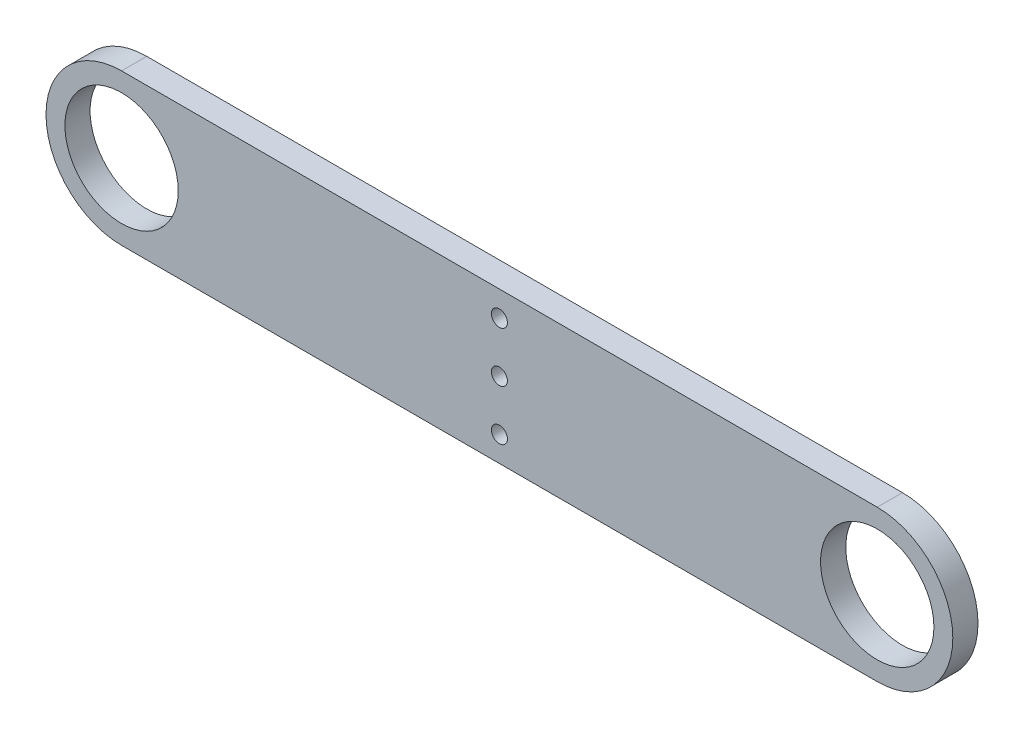
ISO-10303-21;
HEADER;
FILE_DESCRIPTION(('STEP AP214'),'2;1');
FILE_NAME('part.step','',(''),(''),'','','');
FILE_SCHEMA(('AUTOMOTIVE_DESIGN { 1 0 10303 214 1 1 1 1 }'));
ENDSEC;
DATA;
#1=APPLICATION_CONTEXT('core data for automotive mechanical design processes');
#2=APPLICATION_PROTOCOL_DEFINITION('international standard','automotive_design',2000,#1);
#3=PRODUCT_CONTEXT('',#1,'mechanical');
#4=PRODUCT('Part','Part','',(#3));
#5=PRODUCT_RELATED_PRODUCT_CATEGORY('part','',(#4));
#6=PRODUCT_DEFINITION_FORMATION('','',#4);
#7=PRODUCT_DEFINITION_CONTEXT('part definition',#1,'design');
#8=PRODUCT_DEFINITION('design','',#6,#7);
#9=PRODUCT_DEFINITION_SHAPE('','',#8);
#10=(LENGTH_UNIT() NAMED_UNIT(*) SI_UNIT(.MILLI.,.METRE.));
#11=(NAMED_UNIT(*) PLANE_ANGLE_UNIT() SI_UNIT($,.RADIAN.));
#12=(NAMED_UNIT(*) SI_UNIT($,.STERADIAN.) SOLID_ANGLE_UNIT());
#13=UNCERTAINTY_MEASURE_WITH_UNIT(LENGTH_MEASURE(1.E-05),#10,'distance_accuracy_value','');
#14=(GEOMETRIC_REPRESENTATION_CONTEXT(3) GLOBAL_UNCERTAINTY_ASSIGNED_CONTEXT((#13)) GLOBAL_UNIT_ASSIGNED_CONTEXT((#10,
#11,#12)) REPRESENTATION_CONTEXT('',''));
#15=CARTESIAN_POINT('',(0.,0.,0.));
#16=DIRECTION('',(0.,0.,1.));
#17=DIRECTION('',(1.,0.,0.));
#18=AXIS2_PLACEMENT_3D('',#15,#16,#17);
#19=CARTESIAN_POINT('',(0.,19.05,6.35));
#20=DIRECTION('',(0.,1.,0.));
#21=DIRECTION('',(0.,0.,1.));
#22=AXIS2_PLACEMENT_3D('',#19,#20,#21);
#23=PLANE('',#22);
#24=DIRECTION('',(1.,0.,0.));
#25=VECTOR('',#24,1.);
#26=CARTESIAN_POINT('',(0.,19.05,0.));
#27=LINE('',#26,#25);
#28=CARTESIAN_POINT('',(-95.25,19.05,0.));
#29=VERTEX_POINT('',#28);
#30=CARTESIAN_POINT('',(95.25,19.05,0.));
#31=VERTEX_POINT('',#30);
#32=EDGE_CURVE('E115',#29,#31,#27,.T.);
#33=ORIENTED_EDGE('',*,*,#32,.F.);
#34=DIRECTION('',(0.,0.,-1.));
#35=VECTOR('',#34,1.);
#36=CARTESIAN_POINT('',(-95.25,19.05,6.35));
#37=LINE('',#36,#35);
#38=CARTESIAN_POINT('',(-95.25,19.05,6.35));
#39=VERTEX_POINT('',#38);
#40=EDGE_CURVE('E11',#39,#29,#37,.T.);
#41=ORIENTED_EDGE('',*,*,#40,.F.);
#42=DIRECTION('',(1.,0.,0.));
#43=VECTOR('',#42,1.);
#44=CARTESIAN_POINT('',(0.,19.05,6.35));
#45=LINE('',#44,#43);
#46=CARTESIAN_POINT('',(95.25,19.05,6.35));
#47=VERTEX_POINT('',#46);
#48=EDGE_CURVE('E85',#39,#47,#45,.T.);
#49=ORIENTED_EDGE('',*,*,#48,.T.);
#50=DIRECTION('',(0.,0.,-1.));
#51=VECTOR('',#50,1.);
#52=CARTESIAN_POINT('',(95.25,19.05,6.35));
#53=LINE('',#52,#51);
#54=EDGE_CURVE('E52',#47,#31,#53,.T.);
#55=ORIENTED_EDGE('',*,*,#54,.T.);
#56=EDGE_LOOP('',(#33,#41,#49,#55));
#57=FACE_BOUND('',#56,.T.);
#58=ADVANCED_FACE('F35',(#57),#23,.T.);
#59=CARTESIAN_POINT('',(-95.25,0.,6.35));
#60=DIRECTION('',(0.,0.,-1.));
#61=DIRECTION('',(-1.,0.,0.));
#62=AXIS2_PLACEMENT_3D('',#59,#60,#61);
#63=CYLINDRICAL_SURFACE('',#62,19.05);
#64=CARTESIAN_POINT('',(-95.25,0.,0.));
#65=DIRECTION('',(0.,0.,1.));
#66=DIRECTION('',(1.,0.,0.));
#67=AXIS2_PLACEMENT_3D('',#64,#65,#66);
#68=CIRCLE('',#67,19.05);
#69=CARTESIAN_POINT('',(-95.25,-19.05,0.));
#70=VERTEX_POINT('',#69);
#71=EDGE_CURVE('E91',#29,#70,#68,.T.);
#72=ORIENTED_EDGE('',*,*,#71,.T.);
#73=DIRECTION('',(0.,0.,-1.));
#74=VECTOR('',#73,1.);
#75=CARTESIAN_POINT('',(-95.25,-19.05,6.35));
#76=LINE('',#75,#74);
#77=CARTESIAN_POINT('',(-95.25,-19.05,6.35));
#78=VERTEX_POINT('',#77);
#79=EDGE_CURVE('E44',#78,#70,#76,.T.);
#80=ORIENTED_EDGE('',*,*,#79,.F.);
#81=CARTESIAN_POINT('',(-95.25,0.,6.35));
#82=DIRECTION('',(0.,0.,1.));
#83=DIRECTION('',(1.,0.,0.));
#84=AXIS2_PLACEMENT_3D('',#81,#82,#83);
#85=CIRCLE('',#84,19.05);
#86=EDGE_CURVE('E78',#39,#78,#85,.T.);
#87=ORIENTED_EDGE('',*,*,#86,.F.);
#88=ORIENTED_EDGE('',*,*,#40,.T.);
#89=EDGE_LOOP('',(#72,#80,#87,#88));
#90=FACE_BOUND('',#89,.T.);
#91=ADVANCED_FACE('F89',(#90),#63,.T.);
#92=CARTESIAN_POINT('',(0.,-19.05,6.35));
#93=DIRECTION('',(0.,-1.,0.));
#94=DIRECTION('',(1.,0.,0.));
#95=AXIS2_PLACEMENT_3D('',#92,#93,#94);
#96=PLANE('',#95);
#97=DIRECTION('',(-1.,0.,0.));
#98=VECTOR('',#97,1.);
#99=CARTESIAN_POINT('',(0.,-19.05,0.));
#100=LINE('',#99,#98);
#101=CARTESIAN_POINT('',(95.25,-19.05,0.));
#102=VERTEX_POINT('',#101);
#103=EDGE_CURVE('E118',#102,#70,#100,.T.);
#104=ORIENTED_EDGE('',*,*,#103,.F.);
#105=DIRECTION('',(0.,0.,-1.));
#106=VECTOR('',#105,1.);
#107=CARTESIAN_POINT('',(95.25,-19.05,6.35));
#108=LINE('',#107,#106);
#109=CARTESIAN_POINT('',(95.25,-19.05,6.35));
#110=VERTEX_POINT('',#109);
#111=EDGE_CURVE('E65',#110,#102,#108,.T.);
#112=ORIENTED_EDGE('',*,*,#111,.F.);
#113=DIRECTION('',(-1.,0.,0.));
#114=VECTOR('',#113,1.);
#115=CARTESIAN_POINT('',(0.,-19.05,6.35));
#116=LINE('',#115,#114);
#117=EDGE_CURVE('E84',#110,#78,#116,.T.);
#118=ORIENTED_EDGE('',*,*,#117,.T.);
#119=ORIENTED_EDGE('',*,*,#79,.T.);
#120=EDGE_LOOP('',(#104,#112,#118,#119));
#121=FACE_BOUND('',#120,.T.);
#122=ADVANCED_FACE('F94',(#121),#96,.T.);
#123=CARTESIAN_POINT('',(95.25,0.,6.35));
#124=DIRECTION('',(0.,0.,-1.));
#125=DIRECTION('',(-1.,0.,0.));
#126=AXIS2_PLACEMENT_3D('',#123,#124,#125);
#127=CYLINDRICAL_SURFACE('',#126,14.2875);
#128=CARTESIAN_POINT('',(95.25,0.,6.35));
#129=DIRECTION('',(0.,0.,1.));
#130=DIRECTION('',(1.,0.,0.));
#131=AXIS2_PLACEMENT_3D('',#128,#129,#130);
#132=CIRCLE('',#131,14.2875);
#133=CARTESIAN_POINT('',(109.5375,0.,6.35));
#134=VERTEX_POINT('',#133);
#135=EDGE_CURVE('E106',#134,#134,#132,.T.);
#136=ORIENTED_EDGE('',*,*,#135,.T.);
#137=EDGE_LOOP('',(#136));
#138=FACE_BOUND('',#137,.T.);
#139=CARTESIAN_POINT('',(95.25,0.,0.));
#140=DIRECTION('',(0.,0.,1.));
#141=DIRECTION('',(1.,0.,0.));
#142=AXIS2_PLACEMENT_3D('',#139,#140,#141);
#143=CIRCLE('',#142,14.2875);
#144=CARTESIAN_POINT('',(109.5375,0.,0.));
#145=VERTEX_POINT('',#144);
#146=EDGE_CURVE('E129',#145,#145,#143,.T.);
#147=ORIENTED_EDGE('',*,*,#146,.F.);
#148=EDGE_LOOP('',(#147));
#149=FACE_BOUND('',#148,.T.);
#150=ADVANCED_FACE('F162',(#138,#149),#127,.F.);
#151=CARTESIAN_POINT('',(0.,0.,6.35));
#152=DIRECTION('',(0.,0.,-1.));
#153=DIRECTION('',(-1.,0.,0.));
#154=AXIS2_PLACEMENT_3D('',#151,#152,#153);
#155=CYLINDRICAL_SURFACE('',#154,2.0193);
#156=CARTESIAN_POINT('',(0.,0.,6.35));
#157=DIRECTION('',(0.,0.,1.));
#158=DIRECTION('',(1.,0.,0.));
#159=AXIS2_PLACEMENT_3D('',#156,#157,#158);
#160=CIRCLE('',#159,2.0193);
#161=CARTESIAN_POINT('',(2.0193,0.,6.35));
#162=VERTEX_POINT('',#161);
#163=EDGE_CURVE('E103',#162,#162,#160,.T.);
#164=ORIENTED_EDGE('',*,*,#163,.T.);
#165=EDGE_LOOP('',(#164));
#166=FACE_BOUND('',#165,.T.);
#167=CARTESIAN_POINT('',(0.,0.,0.));
#168=DIRECTION('',(0.,0.,1.));
#169=DIRECTION('',(1.,0.,0.));
#170=AXIS2_PLACEMENT_3D('',#167,#168,#169);
#171=CIRCLE('',#170,2.0193);
#172=CARTESIAN_POINT('',(2.0193,0.,0.));
#173=VERTEX_POINT('',#172);
#174=EDGE_CURVE('E126',#173,#173,#171,.T.);
#175=ORIENTED_EDGE('',*,*,#174,.F.);
#176=EDGE_LOOP('',(#175));
#177=FACE_BOUND('',#176,.T.);
#178=ADVANCED_FACE('F152',(#166,#177),#155,.F.);
#179=CARTESIAN_POINT('',(0.,12.7,6.35));
#180=DIRECTION('',(0.,0.,-1.));
#181=DIRECTION('',(-1.,0.,0.));
#182=AXIS2_PLACEMENT_3D('',#179,#180,#181);
#183=CYLINDRICAL_SURFACE('',#182,2.0193);
#184=CARTESIAN_POINT('',(0.,12.7,6.35));
#185=DIRECTION('',(0.,0.,1.));
#186=DIRECTION('',(1.,0.,0.));
#187=AXIS2_PLACEMENT_3D('',#184,#185,#186);
#188=CIRCLE('',#187,2.0193);
#189=CARTESIAN_POINT('',(2.0193,12.7,6.35));
#190=VERTEX_POINT('',#189);
#191=EDGE_CURVE('E97',#190,#190,#188,.T.);
#192=ORIENTED_EDGE('',*,*,#191,.T.);
#193=EDGE_LOOP('',(#192));
#194=FACE_BOUND('',#193,.T.);
#195=CARTESIAN_POINT('',(0.,12.7,0.));
#196=DIRECTION('',(0.,0.,1.));
#197=DIRECTION('',(1.,0.,0.));
#198=AXIS2_PLACEMENT_3D('',#195,#196,#197);
#199=CIRCLE('',#198,2.0193);
#200=CARTESIAN_POINT('',(2.0193,12.7,0.));
#201=VERTEX_POINT('',#200);
#202=EDGE_CURVE('E123',#201,#201,#199,.T.);
#203=ORIENTED_EDGE('',*,*,#202,.F.);
#204=EDGE_LOOP('',(#203));
#205=FACE_BOUND('',#204,.T.);
#206=ADVANCED_FACE('F145',(#194,#205),#183,.F.);
#207=CARTESIAN_POINT('',(95.25,0.,6.35));
#208=DIRECTION('',(0.,0.,-1.));
#209=DIRECTION('',(-1.,0.,0.));
#210=AXIS2_PLACEMENT_3D('',#207,#208,#209);
#211=CYLINDRICAL_SURFACE('',#210,19.05);
#212=CARTESIAN_POINT('',(95.25,0.,0.));
#213=DIRECTION('',(0.,0.,1.));
#214=DIRECTION('',(1.,0.,0.));
#215=AXIS2_PLACEMENT_3D('',#212,#213,#214);
#216=CIRCLE('',#215,19.05);
#217=EDGE_CURVE('E120',#31,#102,#216,.F.);
#218=ORIENTED_EDGE('',*,*,#217,.F.);
#219=ORIENTED_EDGE('',*,*,#54,.F.);
#220=CARTESIAN_POINT('',(95.25,0.,6.35));
#221=DIRECTION('',(0.,0.,1.));
#222=DIRECTION('',(1.,0.,0.));
#223=AXIS2_PLACEMENT_3D('',#220,#221,#222);
#224=CIRCLE('',#223,19.05);
#225=EDGE_CURVE('E95',#47,#110,#224,.F.);
#226=ORIENTED_EDGE('',*,*,#225,.T.);
#227=ORIENTED_EDGE('',*,*,#111,.T.);
#228=EDGE_LOOP('',(#218,#219,#226,#227));
#229=FACE_BOUND('',#228,.T.);
#230=ADVANCED_FACE('F143',(#229),#211,.T.);
#231=CARTESIAN_POINT('',(0.,-12.7,6.35));
#232=DIRECTION('',(0.,0.,-1.));
#233=DIRECTION('',(-1.,0.,0.));
#234=AXIS2_PLACEMENT_3D('',#231,#232,#233);
#235=CYLINDRICAL_SURFACE('',#234,2.0193);
#236=CARTESIAN_POINT('',(0.,-12.7,6.35));
#237=DIRECTION('',(0.,0.,1.));
#238=DIRECTION('',(1.,0.,0.));
#239=AXIS2_PLACEMENT_3D('',#236,#237,#238);
#240=CIRCLE('',#239,2.0193);
#241=CARTESIAN_POINT('',(2.0193,-12.7,6.35));
#242=VERTEX_POINT('',#241);
#243=EDGE_CURVE('E135',#242,#242,#240,.T.);
#244=ORIENTED_EDGE('',*,*,#243,.T.);
#245=EDGE_LOOP('',(#244));
#246=FACE_BOUND('',#245,.T.);
#247=CARTESIAN_POINT('',(0.,-12.7,0.));
#248=DIRECTION('',(0.,0.,1.));
#249=DIRECTION('',(1.,0.,0.));
#250=AXIS2_PLACEMENT_3D('',#247,#248,#249);
#251=CIRCLE('',#250,2.0193);
#252=CARTESIAN_POINT('',(2.0193,-12.7,0.));
#253=VERTEX_POINT('',#252);
#254=EDGE_CURVE('E112',#253,#253,#251,.T.);
#255=ORIENTED_EDGE('',*,*,#254,.F.);
#256=EDGE_LOOP('',(#255));
#257=FACE_BOUND('',#256,.T.);
#258=ADVANCED_FACE('F37',(#246,#257),#235,.F.);
#259=CARTESIAN_POINT('',(-95.25,0.,6.35));
#260=DIRECTION('',(0.,0.,-1.));
#261=DIRECTION('',(-1.,0.,0.));
#262=AXIS2_PLACEMENT_3D('',#259,#260,#261);
#263=CYLINDRICAL_SURFACE('',#262,14.2875);
#264=CARTESIAN_POINT('',(-95.25,0.,6.35));
#265=DIRECTION('',(0.,0.,1.));
#266=DIRECTION('',(1.,0.,0.));
#267=AXIS2_PLACEMENT_3D('',#264,#265,#266);
#268=CIRCLE('',#267,14.2875);
#269=CARTESIAN_POINT('',(-80.9625,0.,6.35));
#270=VERTEX_POINT('',#269);
#271=EDGE_CURVE('E109',#270,#270,#268,.T.);
#272=ORIENTED_EDGE('',*,*,#271,.T.);
#273=EDGE_LOOP('',(#272));
#274=FACE_BOUND('',#273,.T.);
#275=CARTESIAN_POINT('',(-95.25,0.,0.));
#276=DIRECTION('',(0.,0.,1.));
#277=DIRECTION('',(1.,0.,0.));
#278=AXIS2_PLACEMENT_3D('',#275,#276,#277);
#279=CIRCLE('',#278,14.2875);
#280=CARTESIAN_POINT('',(-80.9625,0.,0.));
#281=VERTEX_POINT('',#280);
#282=EDGE_CURVE('E132',#281,#281,#279,.T.);
#283=ORIENTED_EDGE('',*,*,#282,.F.);
#284=EDGE_LOOP('',(#283));
#285=FACE_BOUND('',#284,.T.);
#286=ADVANCED_FACE('F151',(#274,#285),#263,.F.);
#287=CARTESIAN_POINT('',(0.,0.,6.35));
#288=DIRECTION('',(0.,0.,1.));
#289=DIRECTION('',(1.,0.,0.));
#290=AXIS2_PLACEMENT_3D('',#287,#288,#289);
#291=PLANE('',#290);
#292=ORIENTED_EDGE('',*,*,#243,.F.);
#293=EDGE_LOOP('',(#292));
#294=FACE_BOUND('',#293,.T.);
#295=ORIENTED_EDGE('',*,*,#48,.F.);
#296=ORIENTED_EDGE('',*,*,#86,.T.);
#297=ORIENTED_EDGE('',*,*,#117,.F.);
#298=ORIENTED_EDGE('',*,*,#225,.F.);
#299=EDGE_LOOP('',(#295,#296,#297,#298));
#300=FACE_BOUND('',#299,.T.);
#301=ORIENTED_EDGE('',*,*,#191,.F.);
#302=EDGE_LOOP('',(#301));
#303=FACE_BOUND('',#302,.T.);
#304=ORIENTED_EDGE('',*,*,#163,.F.);
#305=EDGE_LOOP('',(#304));
#306=FACE_BOUND('',#305,.T.);
#307=ORIENTED_EDGE('',*,*,#135,.F.);
#308=EDGE_LOOP('',(#307));
#309=FACE_BOUND('',#308,.T.);
#310=ORIENTED_EDGE('',*,*,#271,.F.);
#311=EDGE_LOOP('',(#310));
#312=FACE_BOUND('',#311,.T.);
#313=ADVANCED_FACE('F80',(#294,#300,#303,#306,#309,#312),#291,.T.);
#314=CARTESIAN_POINT('',(0.,0.,0.));
#315=DIRECTION('',(0.,0.,1.));
#316=DIRECTION('',(1.,0.,0.));
#317=AXIS2_PLACEMENT_3D('',#314,#315,#316);
#318=PLANE('',#317);
#319=ORIENTED_EDGE('',*,*,#254,.T.);
#320=EDGE_LOOP('',(#319));
#321=FACE_BOUND('',#320,.T.);
#322=ORIENTED_EDGE('',*,*,#32,.T.);
#323=ORIENTED_EDGE('',*,*,#217,.T.);
#324=ORIENTED_EDGE('',*,*,#103,.T.);
#325=ORIENTED_EDGE('',*,*,#71,.F.);
#326=EDGE_LOOP('',(#322,#323,#324,#325));
#327=FACE_BOUND('',#326,.T.);
#328=ORIENTED_EDGE('',*,*,#202,.T.);
#329=EDGE_LOOP('',(#328));
#330=FACE_BOUND('',#329,.T.);
#331=ORIENTED_EDGE('',*,*,#174,.T.);
#332=EDGE_LOOP('',(#331));
#333=FACE_BOUND('',#332,.T.);
#334=ORIENTED_EDGE('',*,*,#146,.T.);
#335=EDGE_LOOP('',(#334));
#336=FACE_BOUND('',#335,.T.);
#337=ORIENTED_EDGE('',*,*,#282,.T.);
#338=EDGE_LOOP('',(#337));
#339=FACE_BOUND('',#338,.T.);
#340=ADVANCED_FACE('F178',(#321,#327,#330,#333,#336,#339),#318,.F.);
#341=CLOSED_SHELL('',(#58,#91,#122,#150,#178,#206,#230,#258,#286,#313,#340));
#342=MANIFOLD_SOLID_BREP('B2',#341);
#343=ADVANCED_BREP_SHAPE_REPRESENTATION('',(#18,#342),#14);
#344=SHAPE_DEFINITION_REPRESENTATION(#9,#343);
ENDSEC;
END-ISO-10303-21;
